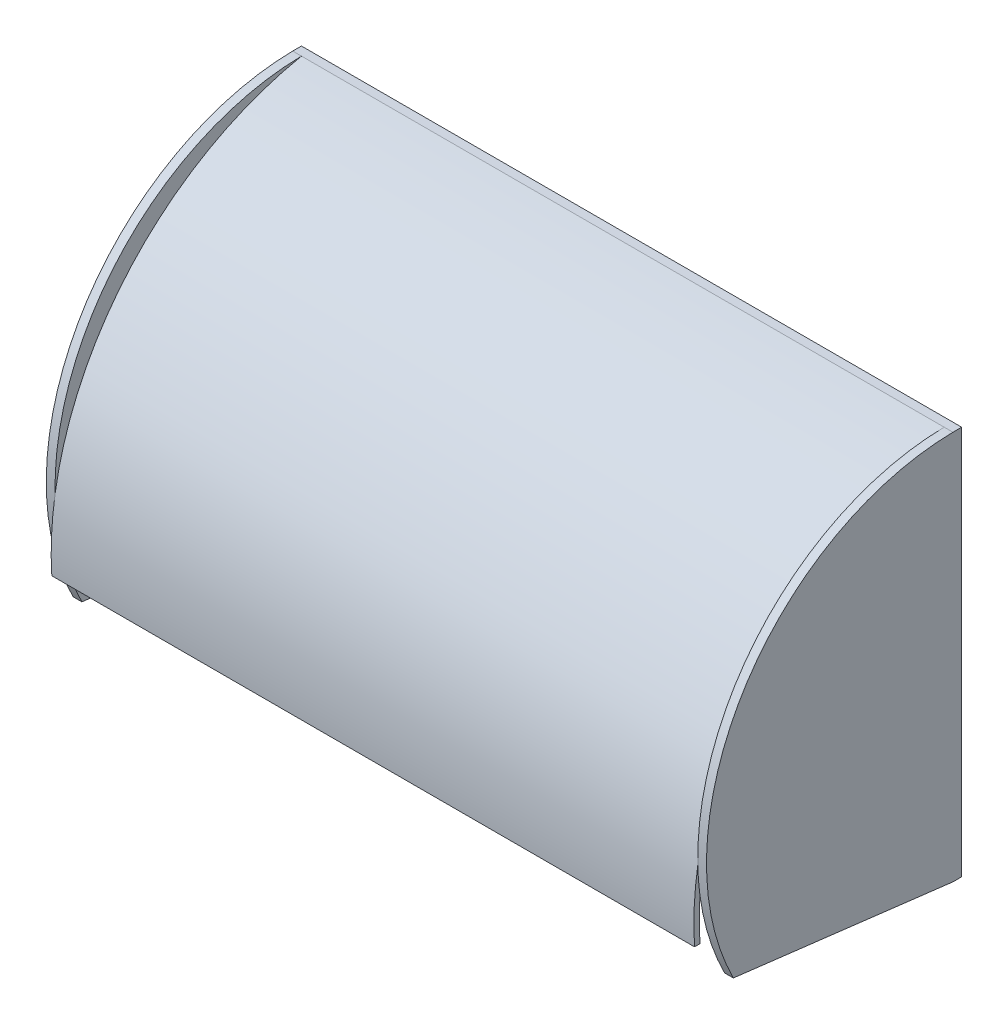
ISO-10303-21;
HEADER;
FILE_DESCRIPTION(('STEP AP214'),'2;1');
FILE_NAME('part.step','',(''),(''),'','','');
FILE_SCHEMA(('AUTOMOTIVE_DESIGN { 1 0 10303 214 1 1 1 1 }'));
ENDSEC;
DATA;
#1=APPLICATION_CONTEXT('core data for automotive mechanical design processes');
#2=APPLICATION_PROTOCOL_DEFINITION('international standard','automotive_design',2000,#1);
#3=PRODUCT_CONTEXT('',#1,'mechanical');
#4=PRODUCT('Part','Part','',(#3));
#5=PRODUCT_RELATED_PRODUCT_CATEGORY('part','',(#4));
#6=PRODUCT_DEFINITION_FORMATION('','',#4);
#7=PRODUCT_DEFINITION_CONTEXT('part definition',#1,'design');
#8=PRODUCT_DEFINITION('design','',#6,#7);
#9=PRODUCT_DEFINITION_SHAPE('','',#8);
#10=(LENGTH_UNIT() NAMED_UNIT(*) SI_UNIT(.MILLI.,.METRE.));
#11=(NAMED_UNIT(*) PLANE_ANGLE_UNIT() SI_UNIT($,.RADIAN.));
#12=(NAMED_UNIT(*) SI_UNIT($,.STERADIAN.) SOLID_ANGLE_UNIT());
#13=UNCERTAINTY_MEASURE_WITH_UNIT(LENGTH_MEASURE(1.E-05),#10,'distance_accuracy_value','');
#14=(GEOMETRIC_REPRESENTATION_CONTEXT(3) GLOBAL_UNCERTAINTY_ASSIGNED_CONTEXT((#13)) GLOBAL_UNIT_ASSIGNED_CONTEXT((#10,
#11,#12)) REPRESENTATION_CONTEXT('',''));
#15=CARTESIAN_POINT('',(0.,0.,0.));
#16=DIRECTION('',(0.,0.,1.));
#17=DIRECTION('',(1.,0.,0.));
#18=AXIS2_PLACEMENT_3D('',#15,#16,#17);
#19=CARTESIAN_POINT('',(-93.3016015183748,56.5286432679461,2.54));
#20=DIRECTION('',(1.,0.,0.));
#21=DIRECTION('',(0.,0.,-1.));
#22=AXIS2_PLACEMENT_3D('',#19,#20,#21);
#23=PLANE('',#22);
#24=CARTESIAN_POINT('',(-93.3016015183748,-16.0784560152379,1.470182778071));
#25=DIRECTION('',(-1.,0.,0.));
#26=DIRECTION('',(0.,0.,-1.));
#27=AXIS2_PLACEMENT_3D('',#24,#25,#26);
#28=CIRCLE('',#27,72.6149803773745);
#29=CARTESIAN_POINT('',(-93.3016015183748,-25.7488752560974,73.4383588485571));
#30=VERTEX_POINT('',#29);
#31=CARTESIAN_POINT('',(-93.3016015183748,-17.756691248688,74.0657673663067));
#32=VERTEX_POINT('',#31);
#33=EDGE_CURVE('E44',#30,#32,#28,.T.);
#34=ORIENTED_EDGE('',*,*,#33,.F.);
#35=CARTESIAN_POINT('',(-93.3016015183748,-31.7224023935768,-15.1792259898967));
#36=DIRECTION('',(1.,0.,0.));
#37=DIRECTION('',(0.,0.,-1.));
#38=AXIS2_PLACEMENT_3D('',#35,#36,#37);
#39=CIRCLE('',#38,88.8186881746334);
#40=CARTESIAN_POINT('',(-93.3016015183748,-37.8981804210402,73.4244936544742));
#41=VERTEX_POINT('',#40);
#42=EDGE_CURVE('E209',#30,#41,#39,.T.);
#43=ORIENTED_EDGE('',*,*,#42,.T.);
#44=DIRECTION('',(0.,0.,1.));
#45=VECTOR('',#44,1.);
#46=CARTESIAN_POINT('',(-93.3016015183748,-37.8981804210402,73.4244936544742));
#47=LINE('',#46,#45);
#48=CARTESIAN_POINT('',(-93.3016015183748,-37.8981804210402,75.0178105490525));
#49=VERTEX_POINT('',#48);
#50=EDGE_CURVE('E213',#41,#49,#47,.T.);
#51=ORIENTED_EDGE('',*,*,#50,.T.);
#52=CARTESIAN_POINT('',(-93.3016015183748,-32.0662299503542,-15.1344225086372));
#53=DIRECTION('',(-1.,0.,0.));
#54=DIRECTION('',(0.,0.,-1.));
#55=AXIS2_PLACEMENT_3D('',#52,#53,#54);
#56=CIRCLE('',#55,90.3406706394221);
#57=EDGE_CURVE('E207',#49,#32,#56,.T.);
#58=ORIENTED_EDGE('',*,*,#57,.T.);
#59=EDGE_LOOP('',(#34,#43,#51,#58));
#60=FACE_BOUND('',#59,.T.);
#61=ADVANCED_FACE('F35',(#60),#23,.F.);
#62=CARTESIAN_POINT('',(93.3016015183748,56.5286432679461,2.54));
#63=DIRECTION('',(-1.,0.,0.));
#64=DIRECTION('',(0.,0.,1.));
#65=AXIS2_PLACEMENT_3D('',#62,#63,#64);
#66=PLANE('',#65);
#67=CARTESIAN_POINT('',(93.3016015183748,-31.7224023935768,-15.1792259898967));
#68=DIRECTION('',(-1.,0.,0.));
#69=DIRECTION('',(0.,0.,1.));
#70=AXIS2_PLACEMENT_3D('',#67,#68,#69);
#71=CIRCLE('',#70,88.8186881746334);
#72=CARTESIAN_POINT('',(93.3016015183748,-37.8981804210402,73.4244936544742));
#73=VERTEX_POINT('',#72);
#74=CARTESIAN_POINT('',(93.3016015183748,-25.7488752560974,73.4383588485571));
#75=VERTEX_POINT('',#74);
#76=EDGE_CURVE('E197',#73,#75,#71,.T.);
#77=ORIENTED_EDGE('',*,*,#76,.T.);
#78=CARTESIAN_POINT('',(93.3016015183748,-16.0784560152379,1.470182778071));
#79=DIRECTION('',(-1.,0.,0.));
#80=DIRECTION('',(0.,0.,-1.));
#81=AXIS2_PLACEMENT_3D('',#78,#79,#80);
#82=CIRCLE('',#81,72.6149803773745);
#83=CARTESIAN_POINT('',(93.3016015183748,-17.756691248688,74.0657673663067));
#84=VERTEX_POINT('',#83);
#85=EDGE_CURVE('E11',#75,#84,#82,.T.);
#86=ORIENTED_EDGE('',*,*,#85,.T.);
#87=CARTESIAN_POINT('',(93.3016015183748,-32.0662299503542,-15.1344225086372));
#88=DIRECTION('',(-1.,0.,0.));
#89=DIRECTION('',(0.,0.,1.));
#90=AXIS2_PLACEMENT_3D('',#87,#88,#89);
#91=CIRCLE('',#90,90.3406706394221);
#92=CARTESIAN_POINT('',(93.3016015183748,-37.8981804210402,75.0178105490525));
#93=VERTEX_POINT('',#92);
#94=EDGE_CURVE('E203',#84,#93,#91,.F.);
#95=ORIENTED_EDGE('',*,*,#94,.T.);
#96=DIRECTION('',(0.,0.,-1.));
#97=VECTOR('',#96,1.);
#98=CARTESIAN_POINT('',(93.3016015183748,-37.8981804210402,73.4244936544742));
#99=LINE('',#98,#97);
#100=EDGE_CURVE('E200',#93,#73,#99,.T.);
#101=ORIENTED_EDGE('',*,*,#100,.T.);
#102=EDGE_LOOP('',(#77,#86,#95,#101));
#103=FACE_BOUND('',#102,.T.);
#104=ADVANCED_FACE('F37',(#103),#66,.F.);
#105=CARTESIAN_POINT('',(-93.3016015183748,56.5286432679461,2.54));
#106=DIRECTION('',(0.,-1.,0.));
#107=DIRECTION('',(0.,0.,-1.));
#108=AXIS2_PLACEMENT_3D('',#105,#106,#107);
#109=PLANE('',#108);
#110=DIRECTION('',(-1.,0.,0.));
#111=VECTOR('',#110,1.);
#112=CARTESIAN_POINT('',(-93.3016015183748,56.5286432679461,0.));
#113=LINE('',#112,#111);
#114=CARTESIAN_POINT('',(95.8416015183748,56.5286432679461,0.));
#115=VERTEX_POINT('',#114);
#116=CARTESIAN_POINT('',(-95.8416015183748,56.5286432679461,0.));
#117=VERTEX_POINT('',#116);
#118=EDGE_CURVE('E206',#115,#117,#113,.T.);
#119=ORIENTED_EDGE('',*,*,#118,.T.);
#120=DIRECTION('',(0.,0.,-1.));
#121=VECTOR('',#120,1.);
#122=CARTESIAN_POINT('',(-95.8416015183748,56.5286432679461,2.54));
#123=LINE('',#122,#121);
#124=CARTESIAN_POINT('',(-95.8416015183748,56.5286432679461,2.54));
#125=VERTEX_POINT('',#124);
#126=EDGE_CURVE('E172',#125,#117,#123,.T.);
#127=ORIENTED_EDGE('',*,*,#126,.F.);
#128=DIRECTION('',(1.,0.,0.));
#129=VECTOR('',#128,1.);
#130=CARTESIAN_POINT('',(-95.8416015183748,56.5286432679461,2.54));
#131=LINE('',#130,#129);
#132=CARTESIAN_POINT('',(-93.3016015183748,56.5286432679461,2.54));
#133=VERTEX_POINT('',#132);
#134=EDGE_CURVE('E193',#125,#133,#131,.T.);
#135=ORIENTED_EDGE('',*,*,#134,.T.);
#136=DIRECTION('',(-1.,0.,0.));
#137=VECTOR('',#136,1.);
#138=CARTESIAN_POINT('',(-93.3016015183748,56.5286432679461,2.54));
#139=LINE('',#138,#137);
#140=CARTESIAN_POINT('',(93.3016015183748,56.5286432679461,2.54));
#141=VERTEX_POINT('',#140);
#142=EDGE_CURVE('E226',#141,#133,#139,.T.);
#143=ORIENTED_EDGE('',*,*,#142,.F.);
#144=DIRECTION('',(-1.,0.,0.));
#145=VECTOR('',#144,1.);
#146=CARTESIAN_POINT('',(95.8416015183748,56.5286432679461,2.54));
#147=LINE('',#146,#145);
#148=CARTESIAN_POINT('',(95.8416015183748,56.5286432679461,2.54));
#149=VERTEX_POINT('',#148);
#150=EDGE_CURVE('E164',#149,#141,#147,.T.);
#151=ORIENTED_EDGE('',*,*,#150,.F.);
#152=DIRECTION('',(0.,0.,-1.));
#153=VECTOR('',#152,1.);
#154=CARTESIAN_POINT('',(95.8416015183748,56.5286432679461,2.54));
#155=LINE('',#154,#153);
#156=EDGE_CURVE('E152',#149,#115,#155,.T.);
#157=ORIENTED_EDGE('',*,*,#156,.T.);
#158=EDGE_LOOP('',(#119,#127,#135,#143,#151,#157));
#159=FACE_BOUND('',#158,.T.);
#160=ADVANCED_FACE('F244',(#159),#109,.F.);
#161=CARTESIAN_POINT('',(-93.3016015183748,-56.5286432679461,2.54));
#162=DIRECTION('',(0.,1.,0.));
#163=DIRECTION('',(0.,0.,1.));
#164=AXIS2_PLACEMENT_3D('',#161,#162,#163);
#165=PLANE('',#164);
#166=DIRECTION('',(1.,0.,0.));
#167=VECTOR('',#166,1.);
#168=CARTESIAN_POINT('',(-93.3016015183748,-56.5286432679461,0.));
#169=LINE('',#168,#167);
#170=CARTESIAN_POINT('',(-95.8416015183748,-56.5286432679461,0.));
#171=VERTEX_POINT('',#170);
#172=CARTESIAN_POINT('',(95.8416015183748,-56.5286432679461,0.));
#173=VERTEX_POINT('',#172);
#174=EDGE_CURVE('E39',#171,#173,#169,.T.);
#175=ORIENTED_EDGE('',*,*,#174,.T.);
#176=DIRECTION('',(0.,0.,1.));
#177=VECTOR('',#176,1.);
#178=CARTESIAN_POINT('',(95.8416015183748,-56.5286432679461,0.));
#179=LINE('',#178,#177);
#180=CARTESIAN_POINT('',(95.8416015183748,-56.5286432679461,2.54));
#181=VERTEX_POINT('',#180);
#182=EDGE_CURVE('E157',#173,#181,#179,.T.);
#183=ORIENTED_EDGE('',*,*,#182,.T.);
#184=DIRECTION('',(-1.,0.,0.));
#185=VECTOR('',#184,1.);
#186=CARTESIAN_POINT('',(95.8416015183748,-56.5286432679461,2.54));
#187=LINE('',#186,#185);
#188=CARTESIAN_POINT('',(93.3016015183748,-56.5286432679461,2.54));
#189=VERTEX_POINT('',#188);
#190=EDGE_CURVE('E142',#181,#189,#187,.T.);
#191=ORIENTED_EDGE('',*,*,#190,.T.);
#192=DIRECTION('',(1.,0.,0.));
#193=VECTOR('',#192,1.);
#194=CARTESIAN_POINT('',(-93.3016015183748,-56.5286432679461,2.54));
#195=LINE('',#194,#193);
#196=CARTESIAN_POINT('',(-93.3016015183748,-56.5286432679461,2.54));
#197=VERTEX_POINT('',#196);
#198=EDGE_CURVE('E230',#197,#189,#195,.T.);
#199=ORIENTED_EDGE('',*,*,#198,.F.);
#200=DIRECTION('',(1.,0.,0.));
#201=VECTOR('',#200,1.);
#202=CARTESIAN_POINT('',(-95.8416015183748,-56.5286432679461,2.54));
#203=LINE('',#202,#201);
#204=CARTESIAN_POINT('',(-95.8416015183748,-56.5286432679461,2.54));
#205=VERTEX_POINT('',#204);
#206=EDGE_CURVE('E190',#205,#197,#203,.T.);
#207=ORIENTED_EDGE('',*,*,#206,.F.);
#208=DIRECTION('',(0.,0.,1.));
#209=VECTOR('',#208,1.);
#210=CARTESIAN_POINT('',(-95.8416015183748,-56.5286432679461,0.));
#211=LINE('',#210,#209);
#212=EDGE_CURVE('E179',#171,#205,#211,.T.);
#213=ORIENTED_EDGE('',*,*,#212,.F.);
#214=EDGE_LOOP('',(#175,#183,#191,#199,#207,#213));
#215=FACE_BOUND('',#214,.T.);
#216=ADVANCED_FACE('F235',(#215),#165,.F.);
#217=CARTESIAN_POINT('',(0.,0.,2.54));
#218=DIRECTION('',(0.,0.,1.));
#219=DIRECTION('',(1.,0.,0.));
#220=AXIS2_PLACEMENT_3D('',#217,#218,#219);
#221=PLANE('',#220);
#222=DIRECTION('',(-1.,0.,0.));
#223=VECTOR('',#222,1.);
#224=CARTESIAN_POINT('',(212.451963034384,55.31085791179,2.54));
#225=LINE('',#224,#223);
#226=CARTESIAN_POINT('',(93.3016015183748,55.31085791179,2.54));
#227=VERTEX_POINT('',#226);
#228=CARTESIAN_POINT('',(-93.3016015183748,55.31085791179,2.54));
#229=VERTEX_POINT('',#228);
#230=EDGE_CURVE('E216',#227,#229,#225,.T.);
#231=ORIENTED_EDGE('',*,*,#230,.T.);
#232=DIRECTION('',(0.,-1.,0.));
#233=VECTOR('',#232,1.);
#234=CARTESIAN_POINT('',(-93.3016015183748,56.5286432679461,2.54));
#235=LINE('',#234,#233);
#236=EDGE_CURVE('E228',#229,#197,#235,.T.);
#237=ORIENTED_EDGE('',*,*,#236,.T.);
#238=ORIENTED_EDGE('',*,*,#198,.T.);
#239=DIRECTION('',(0.,1.,0.));
#240=VECTOR('',#239,1.);
#241=CARTESIAN_POINT('',(93.3016015183748,56.5286432679461,2.54));
#242=LINE('',#241,#240);
#243=EDGE_CURVE('E223',#189,#227,#242,.T.);
#244=ORIENTED_EDGE('',*,*,#243,.T.);
#245=EDGE_LOOP('',(#231,#237,#238,#244));
#246=FACE_BOUND('',#245,.T.);
#247=ADVANCED_FACE('F275',(#246),#221,.T.);
#248=CARTESIAN_POINT('',(0.,0.,0.));
#249=DIRECTION('',(0.,0.,1.));
#250=DIRECTION('',(1.,0.,0.));
#251=AXIS2_PLACEMENT_3D('',#248,#249,#250);
#252=PLANE('',#251);
#253=ORIENTED_EDGE('',*,*,#118,.F.);
#254=DIRECTION('',(0.,-1.,0.));
#255=VECTOR('',#254,1.);
#256=CARTESIAN_POINT('',(95.8416015183748,56.5286432679461,0.));
#257=LINE('',#256,#255);
#258=EDGE_CURVE('E159',#115,#173,#257,.T.);
#259=ORIENTED_EDGE('',*,*,#258,.T.);
#260=ORIENTED_EDGE('',*,*,#174,.F.);
#261=DIRECTION('',(0.,-1.,0.));
#262=VECTOR('',#261,1.);
#263=CARTESIAN_POINT('',(-95.8416015183748,56.5286432679461,0.));
#264=LINE('',#263,#262);
#265=EDGE_CURVE('E176',#117,#171,#264,.T.);
#266=ORIENTED_EDGE('',*,*,#265,.F.);
#267=EDGE_LOOP('',(#253,#259,#260,#266));
#268=FACE_BOUND('',#267,.T.);
#269=ADVANCED_FACE('F239',(#268),#252,.F.);
#270=CARTESIAN_POINT('',(212.451963034384,-32.0662299503542,-15.1344225086372));
#271=DIRECTION('',(-1.,0.,0.));
#272=DIRECTION('',(0.,0.,1.));
#273=AXIS2_PLACEMENT_3D('',#270,#271,#272);
#274=CYLINDRICAL_SURFACE('',#273,90.3406706394221);
#275=EDGE_CURVE('E204',#141,#84,#91,.F.);
#276=ORIENTED_EDGE('',*,*,#275,.F.);
#277=ORIENTED_EDGE('',*,*,#142,.T.);
#278=EDGE_CURVE('E196',#32,#133,#56,.T.);
#279=ORIENTED_EDGE('',*,*,#278,.F.);
#280=ORIENTED_EDGE('',*,*,#57,.F.);
#281=DIRECTION('',(-1.,0.,0.));
#282=VECTOR('',#281,1.);
#283=CARTESIAN_POINT('',(212.451963034384,-37.8981804210402,75.0178105490525));
#284=LINE('',#283,#282);
#285=EDGE_CURVE('E217',#93,#49,#284,.T.);
#286=ORIENTED_EDGE('',*,*,#285,.F.);
#287=ORIENTED_EDGE('',*,*,#94,.F.);
#288=EDGE_LOOP('',(#276,#277,#279,#280,#286,#287));
#289=FACE_BOUND('',#288,.T.);
#290=ADVANCED_FACE('F257',(#289),#274,.T.);
#291=CARTESIAN_POINT('',(212.451963034384,-37.8981804210402,73.4244936544742));
#292=DIRECTION('',(0.,-1.,0.));
#293=DIRECTION('',(0.,0.,-1.));
#294=AXIS2_PLACEMENT_3D('',#291,#292,#293);
#295=PLANE('',#294);
#296=ORIENTED_EDGE('',*,*,#100,.F.);
#297=ORIENTED_EDGE('',*,*,#285,.T.);
#298=ORIENTED_EDGE('',*,*,#50,.F.);
#299=DIRECTION('',(-1.,0.,0.));
#300=VECTOR('',#299,1.);
#301=CARTESIAN_POINT('',(212.451963034384,-37.8981804210402,73.4244936544742));
#302=LINE('',#301,#300);
#303=EDGE_CURVE('E219',#73,#41,#302,.T.);
#304=ORIENTED_EDGE('',*,*,#303,.F.);
#305=EDGE_LOOP('',(#296,#297,#298,#304));
#306=FACE_BOUND('',#305,.T.);
#307=ADVANCED_FACE('F292',(#306),#295,.T.);
#308=CARTESIAN_POINT('',(212.451963034384,-31.7224023935768,-15.1792259898967));
#309=DIRECTION('',(-1.,0.,0.));
#310=DIRECTION('',(0.,0.,1.));
#311=AXIS2_PLACEMENT_3D('',#308,#309,#310);
#312=CYLINDRICAL_SURFACE('',#311,88.8186881746334);
#313=ORIENTED_EDGE('',*,*,#76,.F.);
#314=ORIENTED_EDGE('',*,*,#303,.T.);
#315=ORIENTED_EDGE('',*,*,#42,.F.);
#316=EDGE_CURVE('E210',#229,#30,#39,.T.);
#317=ORIENTED_EDGE('',*,*,#316,.F.);
#318=ORIENTED_EDGE('',*,*,#230,.F.);
#319=EDGE_CURVE('E201',#75,#227,#71,.T.);
#320=ORIENTED_EDGE('',*,*,#319,.F.);
#321=EDGE_LOOP('',(#313,#314,#315,#317,#318,#320));
#322=FACE_BOUND('',#321,.T.);
#323=ADVANCED_FACE('F270',(#322),#312,.F.);
#324=CARTESIAN_POINT('',(-93.3016015183748,-16.0784560152379,1.470182778071));
#325=DIRECTION('',(1.,0.,0.));
#326=DIRECTION('',(0.,0.,-1.));
#327=AXIS2_PLACEMENT_3D('',#324,#325,#326);
#328=PLANE('',#327);
#329=ORIENTED_EDGE('',*,*,#236,.F.);
#330=ORIENTED_EDGE('',*,*,#316,.T.);
#331=CARTESIAN_POINT('',(-93.3016015183748,-48.8237819838628,66.2828281678017));
#332=VERTEX_POINT('',#331);
#333=EDGE_CURVE('E184',#332,#30,#28,.T.);
#334=ORIENTED_EDGE('',*,*,#333,.F.);
#335=DIRECTION('',(0.,0.120000707264283,0.992773806189543));
#336=VECTOR('',#335,1.);
#337=CARTESIAN_POINT('',(-93.3016015183748,-48.8237819838628,66.2828281678017));
#338=LINE('',#337,#336);
#339=EDGE_CURVE('E173',#197,#332,#338,.T.);
#340=ORIENTED_EDGE('',*,*,#339,.F.);
#341=EDGE_LOOP('',(#329,#330,#334,#340));
#342=FACE_BOUND('',#341,.T.);
#343=ADVANCED_FACE('F284',(#342),#328,.T.);
#344=CARTESIAN_POINT('',(-95.8416015183748,-16.0784560152379,1.470182778071));
#345=DIRECTION('',(1.,0.,0.));
#346=DIRECTION('',(0.,0.,-1.));
#347=AXIS2_PLACEMENT_3D('',#344,#345,#346);
#348=CYLINDRICAL_SURFACE('',#347,72.6149803773745);
#349=ORIENTED_EDGE('',*,*,#333,.T.);
#350=ORIENTED_EDGE('',*,*,#33,.T.);
#351=EDGE_CURVE('E141',#32,#133,#28,.T.);
#352=ORIENTED_EDGE('',*,*,#351,.T.);
#353=ORIENTED_EDGE('',*,*,#134,.F.);
#354=CARTESIAN_POINT('',(-95.8416015183748,-16.0784560152379,1.470182778071));
#355=DIRECTION('',(-1.,0.,0.));
#356=DIRECTION('',(0.,0.,-1.));
#357=AXIS2_PLACEMENT_3D('',#354,#355,#356);
#358=CIRCLE('',#357,72.6149803773745);
#359=CARTESIAN_POINT('',(-95.8416015183748,-48.8237819838628,66.2828281678017));
#360=VERTEX_POINT('',#359);
#361=EDGE_CURVE('E169',#360,#125,#358,.T.);
#362=ORIENTED_EDGE('',*,*,#361,.F.);
#363=DIRECTION('',(1.,0.,0.));
#364=VECTOR('',#363,1.);
#365=CARTESIAN_POINT('',(-95.8416015183748,-48.8237819838628,66.2828281678017));
#366=LINE('',#365,#364);
#367=EDGE_CURVE('E183',#360,#332,#366,.T.);
#368=ORIENTED_EDGE('',*,*,#367,.T.);
#369=EDGE_LOOP('',(#349,#350,#352,#353,#362,#368));
#370=FACE_BOUND('',#369,.T.);
#371=ADVANCED_FACE('F249',(#370),#348,.T.);
#372=CARTESIAN_POINT('',(-95.8416015183748,-48.8237819838628,66.2828281678017));
#373=DIRECTION('',(0.,0.992773806189543,-0.120000707264283));
#374=DIRECTION('',(0.,0.120000707264283,0.992773806189543));
#375=AXIS2_PLACEMENT_3D('',#372,#373,#374);
#376=PLANE('',#375);
#377=ORIENTED_EDGE('',*,*,#339,.T.);
#378=ORIENTED_EDGE('',*,*,#367,.F.);
#379=DIRECTION('',(0.,0.120000707264283,0.992773806189543));
#380=VECTOR('',#379,1.);
#381=CARTESIAN_POINT('',(-95.8416015183748,-48.8237819838628,66.2828281678017));
#382=LINE('',#381,#380);
#383=EDGE_CURVE('E181',#205,#360,#382,.T.);
#384=ORIENTED_EDGE('',*,*,#383,.F.);
#385=ORIENTED_EDGE('',*,*,#206,.T.);
#386=EDGE_LOOP('',(#377,#378,#384,#385));
#387=FACE_BOUND('',#386,.T.);
#388=ADVANCED_FACE('F280',(#387),#376,.F.);
#389=CARTESIAN_POINT('',(-95.8416015183748,-16.0784560152379,1.470182778071));
#390=DIRECTION('',(1.,0.,0.));
#391=DIRECTION('',(0.,0.,-1.));
#392=AXIS2_PLACEMENT_3D('',#389,#390,#391);
#393=PLANE('',#392);
#394=ORIENTED_EDGE('',*,*,#361,.T.);
#395=ORIENTED_EDGE('',*,*,#126,.T.);
#396=ORIENTED_EDGE('',*,*,#265,.T.);
#397=ORIENTED_EDGE('',*,*,#212,.T.);
#398=ORIENTED_EDGE('',*,*,#383,.T.);
#399=EDGE_LOOP('',(#394,#395,#396,#397,#398));
#400=FACE_BOUND('',#399,.T.);
#401=ADVANCED_FACE('F241',(#400),#393,.F.);
#402=ORIENTED_EDGE('',*,*,#351,.F.);
#403=ORIENTED_EDGE('',*,*,#278,.T.);
#404=EDGE_LOOP('',(#402,#403));
#405=FACE_BOUND('',#404,.T.);
#406=ADVANCED_FACE('F253',(#405),#328,.T.);
#407=CARTESIAN_POINT('',(93.3016015183748,-16.0784560152379,1.470182778071));
#408=DIRECTION('',(-1.,0.,0.));
#409=DIRECTION('',(0.,0.,-1.));
#410=AXIS2_PLACEMENT_3D('',#407,#408,#409);
#411=PLANE('',#410);
#412=EDGE_CURVE('E47',#84,#141,#82,.T.);
#413=ORIENTED_EDGE('',*,*,#412,.T.);
#414=ORIENTED_EDGE('',*,*,#275,.T.);
#415=EDGE_LOOP('',(#413,#414));
#416=FACE_BOUND('',#415,.T.);
#417=ADVANCED_FACE('F261',(#416),#411,.T.);
#418=CARTESIAN_POINT('',(95.8416015183748,-16.0784560152379,1.470182778071));
#419=DIRECTION('',(-1.,0.,0.));
#420=DIRECTION('',(0.,0.,1.));
#421=AXIS2_PLACEMENT_3D('',#418,#419,#420);
#422=CYLINDRICAL_SURFACE('',#421,72.6149803773745);
#423=CARTESIAN_POINT('',(93.3016015183748,-48.8237819838628,66.2828281678017));
#424=VERTEX_POINT('',#423);
#425=EDGE_CURVE('E46',#424,#75,#82,.T.);
#426=ORIENTED_EDGE('',*,*,#425,.F.);
#427=DIRECTION('',(-1.,0.,0.));
#428=VECTOR('',#427,1.);
#429=CARTESIAN_POINT('',(95.8416015183748,-48.8237819838628,66.2828281678017));
#430=LINE('',#429,#428);
#431=CARTESIAN_POINT('',(95.8416015183748,-48.8237819838628,66.2828281678017));
#432=VERTEX_POINT('',#431);
#433=EDGE_CURVE('E131',#432,#424,#430,.T.);
#434=ORIENTED_EDGE('',*,*,#433,.F.);
#435=CARTESIAN_POINT('',(95.8416015183748,-16.0784560152379,1.470182778071));
#436=DIRECTION('',(-1.,0.,0.));
#437=DIRECTION('',(0.,0.,-1.));
#438=AXIS2_PLACEMENT_3D('',#435,#436,#437);
#439=CIRCLE('',#438,72.6149803773745);
#440=EDGE_CURVE('E134',#432,#149,#439,.T.);
#441=ORIENTED_EDGE('',*,*,#440,.T.);
#442=ORIENTED_EDGE('',*,*,#150,.T.);
#443=ORIENTED_EDGE('',*,*,#412,.F.);
#444=ORIENTED_EDGE('',*,*,#85,.F.);
#445=EDGE_LOOP('',(#426,#434,#441,#442,#443,#444));
#446=FACE_BOUND('',#445,.T.);
#447=ADVANCED_FACE('F133',(#446),#422,.T.);
#448=CARTESIAN_POINT('',(95.8416015183748,-48.8237819838628,66.2828281678017));
#449=DIRECTION('',(0.,-0.992773806189543,0.120000707264283));
#450=DIRECTION('',(0.,-0.120000707264283,-0.992773806189543));
#451=AXIS2_PLACEMENT_3D('',#448,#449,#450);
#452=PLANE('',#451);
#453=DIRECTION('',(0.,0.120000707264283,0.992773806189543));
#454=VECTOR('',#453,1.);
#455=CARTESIAN_POINT('',(93.3016015183748,-48.8237819838628,66.2828281678017));
#456=LINE('',#455,#454);
#457=EDGE_CURVE('E153',#189,#424,#456,.T.);
#458=ORIENTED_EDGE('',*,*,#457,.F.);
#459=ORIENTED_EDGE('',*,*,#190,.F.);
#460=DIRECTION('',(0.,0.120000707264283,0.992773806189543));
#461=VECTOR('',#460,1.);
#462=CARTESIAN_POINT('',(95.8416015183748,-48.8237819838628,66.2828281678017));
#463=LINE('',#462,#461);
#464=EDGE_CURVE('E148',#181,#432,#463,.T.);
#465=ORIENTED_EDGE('',*,*,#464,.T.);
#466=ORIENTED_EDGE('',*,*,#433,.T.);
#467=EDGE_LOOP('',(#458,#459,#465,#466));
#468=FACE_BOUND('',#467,.T.);
#469=ADVANCED_FACE('F155',(#468),#452,.T.);
#470=CARTESIAN_POINT('',(95.8416015183748,-16.0784560152379,1.470182778071));
#471=DIRECTION('',(-1.,0.,0.));
#472=DIRECTION('',(0.,0.,-1.));
#473=AXIS2_PLACEMENT_3D('',#470,#471,#472);
#474=PLANE('',#473);
#475=ORIENTED_EDGE('',*,*,#440,.F.);
#476=ORIENTED_EDGE('',*,*,#464,.F.);
#477=ORIENTED_EDGE('',*,*,#182,.F.);
#478=ORIENTED_EDGE('',*,*,#258,.F.);
#479=ORIENTED_EDGE('',*,*,#156,.F.);
#480=EDGE_LOOP('',(#475,#476,#477,#478,#479));
#481=FACE_BOUND('',#480,.T.);
#482=ADVANCED_FACE('F146',(#481),#474,.F.);
#483=ORIENTED_EDGE('',*,*,#425,.T.);
#484=ORIENTED_EDGE('',*,*,#319,.T.);
#485=ORIENTED_EDGE('',*,*,#243,.F.);
#486=ORIENTED_EDGE('',*,*,#457,.T.);
#487=EDGE_LOOP('',(#483,#484,#485,#486));
#488=FACE_BOUND('',#487,.T.);
#489=ADVANCED_FACE('F267',(#488),#411,.T.);
#490=CLOSED_SHELL('',(#61,#104,#160,#216,#247,#269,#290,#307,#323,#343,#371,#388,#401,#406,#417,
#447,#469,#482,#489));
#491=MANIFOLD_SOLID_BREP('B2',#490);
#492=ADVANCED_BREP_SHAPE_REPRESENTATION('',(#18,#491),#14);
#493=SHAPE_DEFINITION_REPRESENTATION(#9,#492);
ENDSEC;
END-ISO-10303-21;
